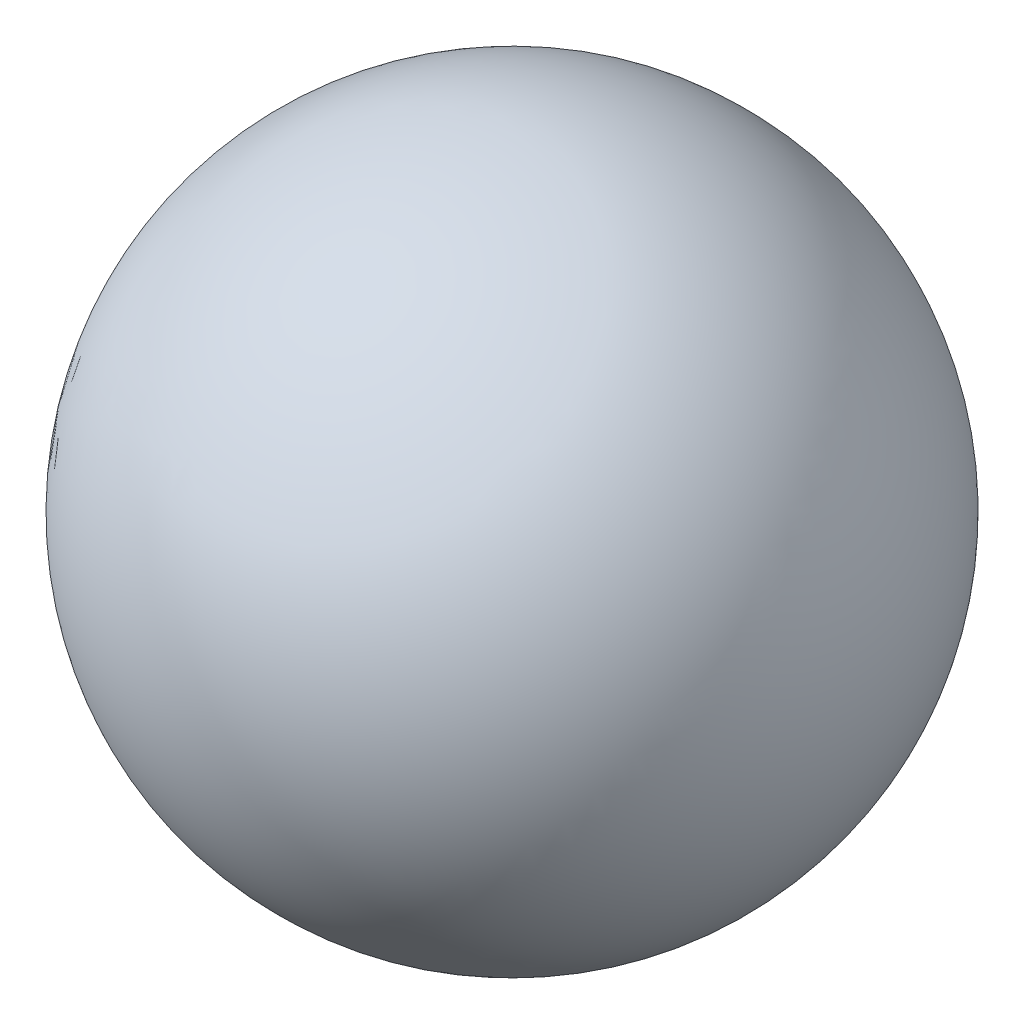
ISO-10303-21;
HEADER;
FILE_DESCRIPTION(('STEP AP214'),'2;1');
FILE_NAME('part.step','',(''),(''),'','','');
FILE_SCHEMA(('AUTOMOTIVE_DESIGN { 1 0 10303 214 1 1 1 1 }'));
ENDSEC;
DATA;
#1=APPLICATION_CONTEXT('core data for automotive mechanical design processes');
#2=APPLICATION_PROTOCOL_DEFINITION('international standard','automotive_design',2000,#1);
#3=PRODUCT_CONTEXT('',#1,'mechanical');
#4=PRODUCT('Part','Part','',(#3));
#5=PRODUCT_RELATED_PRODUCT_CATEGORY('part','',(#4));
#6=PRODUCT_DEFINITION_FORMATION('','',#4);
#7=PRODUCT_DEFINITION_CONTEXT('part definition',#1,'design');
#8=PRODUCT_DEFINITION('design','',#6,#7);
#9=PRODUCT_DEFINITION_SHAPE('','',#8);
#10=(LENGTH_UNIT() NAMED_UNIT(*) SI_UNIT(.MILLI.,.METRE.));
#11=(NAMED_UNIT(*) PLANE_ANGLE_UNIT() SI_UNIT($,.RADIAN.));
#12=(NAMED_UNIT(*) SI_UNIT($,.STERADIAN.) SOLID_ANGLE_UNIT());
#13=UNCERTAINTY_MEASURE_WITH_UNIT(LENGTH_MEASURE(1.E-05),#10,'distance_accuracy_value','');
#14=(GEOMETRIC_REPRESENTATION_CONTEXT(3) GLOBAL_UNCERTAINTY_ASSIGNED_CONTEXT((#13)) GLOBAL_UNIT_ASSIGNED_CONTEXT((#10,
#11,#12)) REPRESENTATION_CONTEXT('',''));
#15=CARTESIAN_POINT('',(0.,0.,0.));
#16=DIRECTION('',(0.,0.,1.));
#17=DIRECTION('',(1.,0.,0.));
#18=AXIS2_PLACEMENT_3D('',#15,#16,#17);
#19=CARTESIAN_POINT('',(0.,0.,0.));
#20=DIRECTION('',(0.686952189615215,0.513903164750313,0.513809523503092));
#21=DIRECTION('',(-0.694915438312685,0.257716947201095,0.671322954113769));
#22=AXIS2_PLACEMENT_3D('',#19,#20,#21);
#23=SPHERICAL_SURFACE('',#22,0.794);
#24=CARTESIAN_POINT('',(-0.545440038554481,-0.408039112811749,-0.407964761661455));
#25=VERTEX_POINT('',#24);
#26=VERTEX_LOOP('',#25);
#27=FACE_BOUND('',#26,.T.);
#28=CARTESIAN_POINT('',(0.545440038554481,0.408039112811748,0.407964761661455));
#29=VERTEX_POINT('',#28);
#30=VERTEX_LOOP('',#29);
#31=FACE_BOUND('',#30,.T.);
#32=ADVANCED_FACE('F15',(#27,#31),#23,.T.);
#33=CLOSED_SHELL('',(#32));
#34=MANIFOLD_SOLID_BREP('B1',#33);
#35=ADVANCED_BREP_SHAPE_REPRESENTATION('',(#18,#34),#14);
#36=SHAPE_DEFINITION_REPRESENTATION(#9,#35);
ENDSEC;
END-ISO-10303-21;
